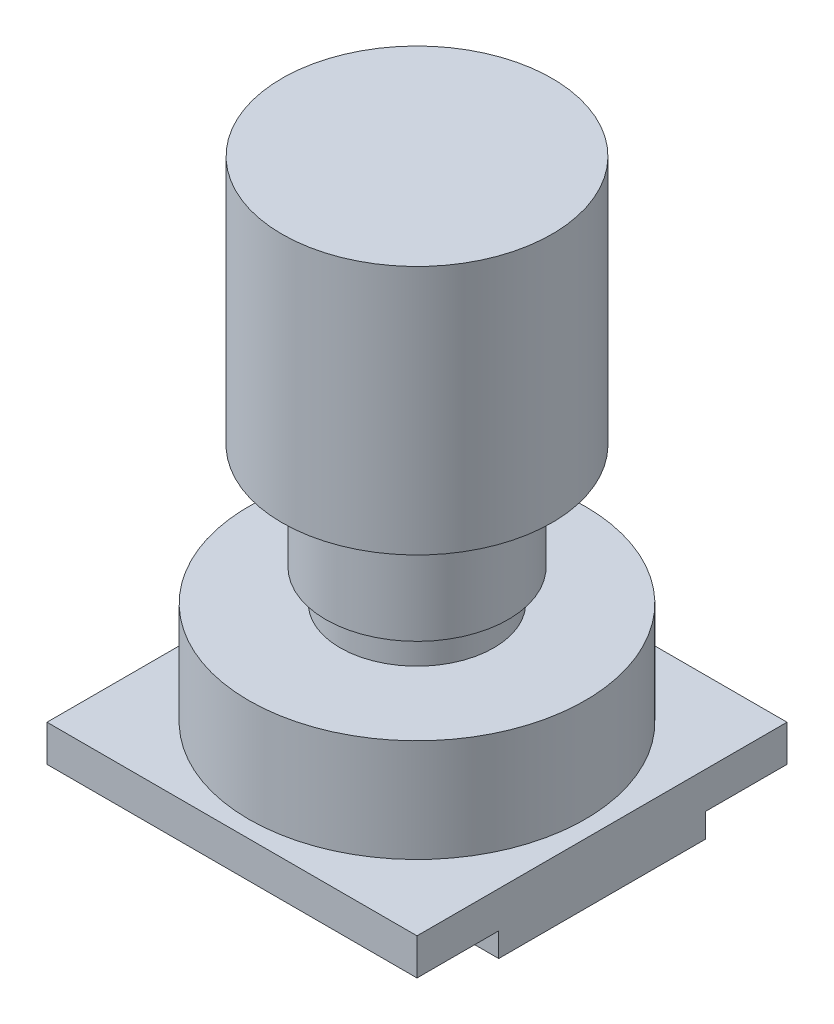
ISO-10303-21;
HEADER;
FILE_DESCRIPTION(('STEP AP214'),'2;1');
FILE_NAME('part.step','',(''),(''),'','','');
FILE_SCHEMA(('AUTOMOTIVE_DESIGN { 1 0 10303 214 1 1 1 1 }'));
ENDSEC;
DATA;
#1=APPLICATION_CONTEXT('core data for automotive mechanical design processes');
#2=APPLICATION_PROTOCOL_DEFINITION('international standard','automotive_design',2000,#1);
#3=PRODUCT_CONTEXT('',#1,'mechanical');
#4=PRODUCT('Part','Part','',(#3));
#5=PRODUCT_RELATED_PRODUCT_CATEGORY('part','',(#4));
#6=PRODUCT_DEFINITION_FORMATION('','',#4);
#7=PRODUCT_DEFINITION_CONTEXT('part definition',#1,'design');
#8=PRODUCT_DEFINITION('design','',#6,#7);
#9=PRODUCT_DEFINITION_SHAPE('','',#8);
#10=(LENGTH_UNIT() NAMED_UNIT(*) SI_UNIT(.MILLI.,.METRE.));
#11=(NAMED_UNIT(*) PLANE_ANGLE_UNIT() SI_UNIT($,.RADIAN.));
#12=(NAMED_UNIT(*) SI_UNIT($,.STERADIAN.) SOLID_ANGLE_UNIT());
#13=UNCERTAINTY_MEASURE_WITH_UNIT(LENGTH_MEASURE(1.E-05),#10,'distance_accuracy_value','');
#14=(GEOMETRIC_REPRESENTATION_CONTEXT(3) GLOBAL_UNCERTAINTY_ASSIGNED_CONTEXT((#13)) GLOBAL_UNIT_ASSIGNED_CONTEXT((#10,
#11,#12)) REPRESENTATION_CONTEXT('',''));
#15=CARTESIAN_POINT('',(0.,0.,0.));
#16=DIRECTION('',(0.,0.,1.));
#17=DIRECTION('',(1.,0.,0.));
#18=AXIS2_PLACEMENT_3D('',#15,#16,#17);
#19=CARTESIAN_POINT('',(19.25,3.8,19.25));
#20=DIRECTION('',(-1.,0.,0.));
#21=DIRECTION('',(0.,0.,1.));
#22=AXIS2_PLACEMENT_3D('',#19,#20,#21);
#23=PLANE('',#22);
#24=DIRECTION('',(0.,0.,-1.));
#25=VECTOR('',#24,1.);
#26=CARTESIAN_POINT('',(19.25,0.,19.25));
#27=LINE('',#26,#25);
#28=CARTESIAN_POINT('',(19.25,0.,19.25));
#29=VERTEX_POINT('',#28);
#30=CARTESIAN_POINT('',(19.25,0.,10.75));
#31=VERTEX_POINT('',#30);
#32=EDGE_CURVE('E136',#29,#31,#27,.T.);
#33=ORIENTED_EDGE('',*,*,#32,.T.);
#34=DIRECTION('',(0.,1.,0.));
#35=VECTOR('',#34,1.);
#36=CARTESIAN_POINT('',(19.25,-2.5,10.75));
#37=LINE('',#36,#35);
#38=CARTESIAN_POINT('',(19.25,-2.5,10.75));
#39=VERTEX_POINT('',#38);
#40=EDGE_CURVE('E115',#39,#31,#37,.T.);
#41=ORIENTED_EDGE('',*,*,#40,.F.);
#42=DIRECTION('',(0.,0.,1.));
#43=VECTOR('',#42,1.);
#44=CARTESIAN_POINT('',(19.25,-2.5,-10.75));
#45=LINE('',#44,#43);
#46=CARTESIAN_POINT('',(19.25,-2.5,-10.75));
#47=VERTEX_POINT('',#46);
#48=EDGE_CURVE('E122',#47,#39,#45,.T.);
#49=ORIENTED_EDGE('',*,*,#48,.F.);
#50=DIRECTION('',(0.,1.,0.));
#51=VECTOR('',#50,1.);
#52=CARTESIAN_POINT('',(19.25,-2.5,-10.75));
#53=LINE('',#52,#51);
#54=CARTESIAN_POINT('',(19.25,0.,-10.75));
#55=VERTEX_POINT('',#54);
#56=EDGE_CURVE('E214',#47,#55,#53,.T.);
#57=ORIENTED_EDGE('',*,*,#56,.T.);
#58=CARTESIAN_POINT('',(19.25,0.,-19.25));
#59=VERTEX_POINT('',#58);
#60=EDGE_CURVE('E67',#55,#59,#27,.T.);
#61=ORIENTED_EDGE('',*,*,#60,.T.);
#62=DIRECTION('',(0.,-1.,0.));
#63=VECTOR('',#62,1.);
#64=CARTESIAN_POINT('',(19.25,3.8,-19.25));
#65=LINE('',#64,#63);
#66=CARTESIAN_POINT('',(19.25,3.8,-19.25));
#67=VERTEX_POINT('',#66);
#68=EDGE_CURVE('E48',#67,#59,#65,.T.);
#69=ORIENTED_EDGE('',*,*,#68,.F.);
#70=DIRECTION('',(0.,0.,-1.));
#71=VECTOR('',#70,1.);
#72=CARTESIAN_POINT('',(19.25,3.8,19.25));
#73=LINE('',#72,#71);
#74=CARTESIAN_POINT('',(19.25,3.8,19.25));
#75=VERTEX_POINT('',#74);
#76=EDGE_CURVE('E171',#75,#67,#73,.T.);
#77=ORIENTED_EDGE('',*,*,#76,.F.);
#78=DIRECTION('',(0.,-1.,0.));
#79=VECTOR('',#78,1.);
#80=CARTESIAN_POINT('',(19.25,3.8,19.25));
#81=LINE('',#80,#79);
#82=EDGE_CURVE('E185',#75,#29,#81,.T.);
#83=ORIENTED_EDGE('',*,*,#82,.T.);
#84=EDGE_LOOP('',(#33,#41,#49,#57,#61,#69,#77,#83));
#85=FACE_BOUND('',#84,.T.);
#86=ADVANCED_FACE('F45',(#85),#23,.F.);
#87=CARTESIAN_POINT('',(-19.25,3.8,-19.25));
#88=DIRECTION('',(0.,0.,1.));
#89=DIRECTION('',(1.,0.,0.));
#90=AXIS2_PLACEMENT_3D('',#87,#88,#89);
#91=PLANE('',#90);
#92=DIRECTION('',(-1.,0.,0.));
#93=VECTOR('',#92,1.);
#94=CARTESIAN_POINT('',(-19.25,0.,-19.25));
#95=LINE('',#94,#93);
#96=CARTESIAN_POINT('',(-19.25,0.,-19.25));
#97=VERTEX_POINT('',#96);
#98=EDGE_CURVE('E188',#59,#97,#95,.T.);
#99=ORIENTED_EDGE('',*,*,#98,.T.);
#100=DIRECTION('',(0.,-1.,0.));
#101=VECTOR('',#100,1.);
#102=CARTESIAN_POINT('',(-19.25,3.8,-19.25));
#103=LINE('',#102,#101);
#104=CARTESIAN_POINT('',(-19.25,3.8,-19.25));
#105=VERTEX_POINT('',#104);
#106=EDGE_CURVE('E201',#105,#97,#103,.T.);
#107=ORIENTED_EDGE('',*,*,#106,.F.);
#108=DIRECTION('',(-1.,0.,0.));
#109=VECTOR('',#108,1.);
#110=CARTESIAN_POINT('',(-19.25,3.8,-19.25));
#111=LINE('',#110,#109);
#112=EDGE_CURVE('E175',#67,#105,#111,.T.);
#113=ORIENTED_EDGE('',*,*,#112,.F.);
#114=ORIENTED_EDGE('',*,*,#68,.T.);
#115=EDGE_LOOP('',(#99,#107,#113,#114));
#116=FACE_BOUND('',#115,.T.);
#117=ADVANCED_FACE('F212',(#116),#91,.F.);
#118=CARTESIAN_POINT('',(-19.25,3.8,19.25));
#119=DIRECTION('',(1.,0.,0.));
#120=DIRECTION('',(0.,0.,-1.));
#121=AXIS2_PLACEMENT_3D('',#118,#119,#120);
#122=PLANE('',#121);
#123=DIRECTION('',(0.,0.,1.));
#124=VECTOR('',#123,1.);
#125=CARTESIAN_POINT('',(-19.25,0.,19.25));
#126=LINE('',#125,#124);
#127=CARTESIAN_POINT('',(-19.25,0.,19.25));
#128=VERTEX_POINT('',#127);
#129=EDGE_CURVE('E191',#97,#128,#126,.T.);
#130=ORIENTED_EDGE('',*,*,#129,.T.);
#131=DIRECTION('',(0.,-1.,0.));
#132=VECTOR('',#131,1.);
#133=CARTESIAN_POINT('',(-19.25,3.8,19.25));
#134=LINE('',#133,#132);
#135=CARTESIAN_POINT('',(-19.25,3.8,19.25));
#136=VERTEX_POINT('',#135);
#137=EDGE_CURVE('E198',#136,#128,#134,.T.);
#138=ORIENTED_EDGE('',*,*,#137,.F.);
#139=DIRECTION('',(0.,0.,1.));
#140=VECTOR('',#139,1.);
#141=CARTESIAN_POINT('',(-19.25,3.8,19.25));
#142=LINE('',#141,#140);
#143=EDGE_CURVE('E179',#105,#136,#142,.T.);
#144=ORIENTED_EDGE('',*,*,#143,.F.);
#145=ORIENTED_EDGE('',*,*,#106,.T.);
#146=EDGE_LOOP('',(#130,#138,#144,#145));
#147=FACE_BOUND('',#146,.T.);
#148=ADVANCED_FACE('F219',(#147),#122,.F.);
#149=CARTESIAN_POINT('',(-19.25,3.8,19.25));
#150=DIRECTION('',(0.,0.,-1.));
#151=DIRECTION('',(-1.,0.,0.));
#152=AXIS2_PLACEMENT_3D('',#149,#150,#151);
#153=PLANE('',#152);
#154=DIRECTION('',(1.,0.,0.));
#155=VECTOR('',#154,1.);
#156=CARTESIAN_POINT('',(-19.25,0.,19.25));
#157=LINE('',#156,#155);
#158=EDGE_CURVE('E176',#128,#29,#157,.T.);
#159=ORIENTED_EDGE('',*,*,#158,.T.);
#160=ORIENTED_EDGE('',*,*,#82,.F.);
#161=DIRECTION('',(1.,0.,0.));
#162=VECTOR('',#161,1.);
#163=CARTESIAN_POINT('',(-19.25,3.8,19.25));
#164=LINE('',#163,#162);
#165=EDGE_CURVE('E182',#136,#75,#164,.T.);
#166=ORIENTED_EDGE('',*,*,#165,.F.);
#167=ORIENTED_EDGE('',*,*,#137,.T.);
#168=EDGE_LOOP('',(#159,#160,#166,#167));
#169=FACE_BOUND('',#168,.T.);
#170=ADVANCED_FACE('F222',(#169),#153,.F.);
#171=CARTESIAN_POINT('',(0.,3.8,0.));
#172=DIRECTION('',(0.,-1.,0.));
#173=DIRECTION('',(0.,0.,-1.));
#174=AXIS2_PLACEMENT_3D('',#171,#172,#173);
#175=PLANE('',#174);
#176=CARTESIAN_POINT('',(0.,3.8,0.));
#177=DIRECTION('',(0.,1.,0.));
#178=DIRECTION('',(0.,0.,1.));
#179=AXIS2_PLACEMENT_3D('',#176,#177,#178);
#180=CIRCLE('',#179,17.5);
#181=CARTESIAN_POINT('',(0.,3.8,17.5));
#182=VERTEX_POINT('',#181);
#183=EDGE_CURVE('E54',#182,#182,#180,.T.);
#184=ORIENTED_EDGE('',*,*,#183,.F.);
#185=EDGE_LOOP('',(#184));
#186=FACE_BOUND('',#185,.T.);
#187=ORIENTED_EDGE('',*,*,#76,.T.);
#188=ORIENTED_EDGE('',*,*,#112,.T.);
#189=ORIENTED_EDGE('',*,*,#143,.T.);
#190=ORIENTED_EDGE('',*,*,#165,.T.);
#191=EDGE_LOOP('',(#187,#188,#189,#190));
#192=FACE_BOUND('',#191,.T.);
#193=ADVANCED_FACE('F225',(#186,#192),#175,.F.);
#194=CARTESIAN_POINT('',(0.,0.,0.));
#195=DIRECTION('',(0.,-1.,0.));
#196=DIRECTION('',(0.,0.,-1.));
#197=AXIS2_PLACEMENT_3D('',#194,#195,#196);
#198=PLANE('',#197);
#199=DIRECTION('',(1.,0.,0.));
#200=VECTOR('',#199,1.);
#201=CARTESIAN_POINT('',(19.25,0.,-10.75));
#202=LINE('',#201,#200);
#203=CARTESIAN_POINT('',(13.25,0.,-10.75));
#204=VERTEX_POINT('',#203);
#205=EDGE_CURVE('E62',#204,#55,#202,.T.);
#206=ORIENTED_EDGE('',*,*,#205,.F.);
#207=DIRECTION('',(0.,0.,-1.));
#208=VECTOR('',#207,1.);
#209=CARTESIAN_POINT('',(13.25,0.,-10.75));
#210=LINE('',#209,#208);
#211=CARTESIAN_POINT('',(13.25,0.,10.75));
#212=VERTEX_POINT('',#211);
#213=EDGE_CURVE('E390',#212,#204,#210,.T.);
#214=ORIENTED_EDGE('',*,*,#213,.F.);
#215=DIRECTION('',(-1.,0.,0.));
#216=VECTOR('',#215,1.);
#217=CARTESIAN_POINT('',(19.25,0.,10.75));
#218=LINE('',#217,#216);
#219=EDGE_CURVE('E393',#31,#212,#218,.T.);
#220=ORIENTED_EDGE('',*,*,#219,.F.);
#221=ORIENTED_EDGE('',*,*,#32,.F.);
#222=ORIENTED_EDGE('',*,*,#158,.F.);
#223=ORIENTED_EDGE('',*,*,#129,.F.);
#224=ORIENTED_EDGE('',*,*,#98,.F.);
#225=ORIENTED_EDGE('',*,*,#60,.F.);
#226=EDGE_LOOP('',(#206,#214,#220,#221,#222,#223,#224,#225));
#227=FACE_BOUND('',#226,.T.);
#228=ADVANCED_FACE('F216',(#227),#198,.T.);
#229=CARTESIAN_POINT('',(0.,14.5,0.));
#230=DIRECTION('',(0.,-1.,0.));
#231=DIRECTION('',(0.,0.,-1.));
#232=AXIS2_PLACEMENT_3D('',#229,#230,#231);
#233=CYLINDRICAL_SURFACE('',#232,17.5);
#234=CARTESIAN_POINT('',(0.,14.5,0.));
#235=DIRECTION('',(0.,1.,0.));
#236=DIRECTION('',(0.,0.,1.));
#237=AXIS2_PLACEMENT_3D('',#234,#235,#236);
#238=CIRCLE('',#237,17.5);
#239=CARTESIAN_POINT('',(0.,14.5,17.5));
#240=VERTEX_POINT('',#239);
#241=EDGE_CURVE('E163',#240,#240,#238,.T.);
#242=ORIENTED_EDGE('',*,*,#241,.F.);
#243=EDGE_LOOP('',(#242));
#244=FACE_BOUND('',#243,.T.);
#245=ORIENTED_EDGE('',*,*,#183,.T.);
#246=EDGE_LOOP('',(#245));
#247=FACE_BOUND('',#246,.T.);
#248=ADVANCED_FACE('F234',(#244,#247),#233,.T.);
#249=CARTESIAN_POINT('',(0.,14.5,0.));
#250=DIRECTION('',(0.,1.,0.));
#251=DIRECTION('',(0.,0.,1.));
#252=AXIS2_PLACEMENT_3D('',#249,#250,#251);
#253=PLANE('',#252);
#254=CARTESIAN_POINT('',(0.,14.5,0.));
#255=DIRECTION('',(0.,1.,0.));
#256=DIRECTION('',(0.,0.,1.));
#257=AXIS2_PLACEMENT_3D('',#254,#255,#256);
#258=CIRCLE('',#257,8.);
#259=CARTESIAN_POINT('',(0.,14.5,8.));
#260=VERTEX_POINT('',#259);
#261=EDGE_CURVE('E11',#260,#260,#258,.T.);
#262=ORIENTED_EDGE('',*,*,#261,.F.);
#263=EDGE_LOOP('',(#262));
#264=FACE_BOUND('',#263,.T.);
#265=ORIENTED_EDGE('',*,*,#241,.T.);
#266=EDGE_LOOP('',(#265));
#267=FACE_BOUND('',#266,.T.);
#268=ADVANCED_FACE('F275',(#264,#267),#253,.T.);
#269=CARTESIAN_POINT('',(0.,17.8,0.));
#270=DIRECTION('',(0.,-1.,0.));
#271=DIRECTION('',(0.,0.,-1.));
#272=AXIS2_PLACEMENT_3D('',#269,#270,#271);
#273=CYLINDRICAL_SURFACE('',#272,8.);
#274=CARTESIAN_POINT('',(0.,17.8,0.));
#275=DIRECTION('',(0.,1.,0.));
#276=DIRECTION('',(0.,0.,1.));
#277=AXIS2_PLACEMENT_3D('',#274,#275,#276);
#278=CIRCLE('',#277,8.);
#279=CARTESIAN_POINT('',(0.,17.8,8.));
#280=VERTEX_POINT('',#279);
#281=EDGE_CURVE('E157',#280,#280,#278,.T.);
#282=ORIENTED_EDGE('',*,*,#281,.F.);
#283=EDGE_LOOP('',(#282));
#284=FACE_BOUND('',#283,.T.);
#285=ORIENTED_EDGE('',*,*,#261,.T.);
#286=EDGE_LOOP('',(#285));
#287=FACE_BOUND('',#286,.T.);
#288=ADVANCED_FACE('F284',(#284,#287),#273,.T.);
#289=CARTESIAN_POINT('',(0.,28.8,0.));
#290=DIRECTION('',(0.,-1.,0.));
#291=DIRECTION('',(0.,0.,-1.));
#292=AXIS2_PLACEMENT_3D('',#289,#290,#291);
#293=CYLINDRICAL_SURFACE('',#292,9.5);
#294=CARTESIAN_POINT('',(0.,28.8,0.));
#295=DIRECTION('',(0.,1.,0.));
#296=DIRECTION('',(0.,0.,1.));
#297=AXIS2_PLACEMENT_3D('',#294,#295,#296);
#298=CIRCLE('',#297,9.5);
#299=CARTESIAN_POINT('',(0.,28.8,9.5));
#300=VERTEX_POINT('',#299);
#301=EDGE_CURVE('E153',#300,#300,#298,.T.);
#302=ORIENTED_EDGE('',*,*,#301,.F.);
#303=EDGE_LOOP('',(#302));
#304=FACE_BOUND('',#303,.T.);
#305=CARTESIAN_POINT('',(0.,17.8,0.));
#306=DIRECTION('',(0.,1.,0.));
#307=DIRECTION('',(0.,0.,1.));
#308=AXIS2_PLACEMENT_3D('',#305,#306,#307);
#309=CIRCLE('',#308,9.5);
#310=CARTESIAN_POINT('',(0.,17.8,9.5));
#311=VERTEX_POINT('',#310);
#312=EDGE_CURVE('E151',#311,#311,#309,.T.);
#313=ORIENTED_EDGE('',*,*,#312,.T.);
#314=EDGE_LOOP('',(#313));
#315=FACE_BOUND('',#314,.T.);
#316=ADVANCED_FACE('F294',(#304,#315),#293,.T.);
#317=CARTESIAN_POINT('',(0.,17.8,0.));
#318=DIRECTION('',(0.,1.,0.));
#319=DIRECTION('',(0.,0.,1.));
#320=AXIS2_PLACEMENT_3D('',#317,#318,#319);
#321=PLANE('',#320);
#322=ORIENTED_EDGE('',*,*,#281,.T.);
#323=EDGE_LOOP('',(#322));
#324=FACE_BOUND('',#323,.T.);
#325=ORIENTED_EDGE('',*,*,#312,.F.);
#326=EDGE_LOOP('',(#325));
#327=FACE_BOUND('',#326,.T.);
#328=ADVANCED_FACE('F304',(#324,#327),#321,.F.);
#329=CARTESIAN_POINT('',(0.,54.8,0.));
#330=DIRECTION('',(0.,-1.,0.));
#331=DIRECTION('',(0.,0.,-1.));
#332=AXIS2_PLACEMENT_3D('',#329,#330,#331);
#333=CYLINDRICAL_SURFACE('',#332,14.05);
#334=CARTESIAN_POINT('',(0.,54.8,0.));
#335=DIRECTION('',(0.,1.,0.));
#336=DIRECTION('',(0.,0.,1.));
#337=AXIS2_PLACEMENT_3D('',#334,#335,#336);
#338=CIRCLE('',#337,14.05);
#339=CARTESIAN_POINT('',(0.,54.8,14.05));
#340=VERTEX_POINT('',#339);
#341=EDGE_CURVE('E143',#340,#340,#338,.T.);
#342=ORIENTED_EDGE('',*,*,#341,.F.);
#343=EDGE_LOOP('',(#342));
#344=FACE_BOUND('',#343,.T.);
#345=CARTESIAN_POINT('',(0.,28.8,0.));
#346=DIRECTION('',(0.,1.,0.));
#347=DIRECTION('',(0.,0.,1.));
#348=AXIS2_PLACEMENT_3D('',#345,#346,#347);
#349=CIRCLE('',#348,14.05);
#350=CARTESIAN_POINT('',(0.,28.8,14.05));
#351=VERTEX_POINT('',#350);
#352=EDGE_CURVE('E138',#351,#351,#349,.T.);
#353=ORIENTED_EDGE('',*,*,#352,.T.);
#354=EDGE_LOOP('',(#353));
#355=FACE_BOUND('',#354,.T.);
#356=ADVANCED_FACE('F314',(#344,#355),#333,.T.);
#357=CARTESIAN_POINT('',(0.,54.8,0.));
#358=DIRECTION('',(0.,1.,0.));
#359=DIRECTION('',(0.,0.,1.));
#360=AXIS2_PLACEMENT_3D('',#357,#358,#359);
#361=PLANE('',#360);
#362=ORIENTED_EDGE('',*,*,#341,.T.);
#363=EDGE_LOOP('',(#362));
#364=FACE_BOUND('',#363,.T.);
#365=ADVANCED_FACE('F324',(#364),#361,.T.);
#366=CARTESIAN_POINT('',(0.,28.8,0.));
#367=DIRECTION('',(0.,1.,0.));
#368=DIRECTION('',(0.,0.,1.));
#369=AXIS2_PLACEMENT_3D('',#366,#367,#368);
#370=PLANE('',#369);
#371=ORIENTED_EDGE('',*,*,#301,.T.);
#372=EDGE_LOOP('',(#371));
#373=FACE_BOUND('',#372,.T.);
#374=ORIENTED_EDGE('',*,*,#352,.F.);
#375=EDGE_LOOP('',(#374));
#376=FACE_BOUND('',#375,.T.);
#377=ADVANCED_FACE('F334',(#373,#376),#370,.F.);
#378=CARTESIAN_POINT('',(19.25,-2.5,10.75));
#379=DIRECTION('',(0.,0.,-1.));
#380=DIRECTION('',(-1.,0.,0.));
#381=AXIS2_PLACEMENT_3D('',#378,#379,#380);
#382=PLANE('',#381);
#383=ORIENTED_EDGE('',*,*,#219,.T.);
#384=DIRECTION('',(0.,1.,0.));
#385=VECTOR('',#384,1.);
#386=CARTESIAN_POINT('',(13.25,-2.5,10.75));
#387=LINE('',#386,#385);
#388=CARTESIAN_POINT('',(13.25,-2.5,10.75));
#389=VERTEX_POINT('',#388);
#390=EDGE_CURVE('E117',#389,#212,#387,.T.);
#391=ORIENTED_EDGE('',*,*,#390,.F.);
#392=DIRECTION('',(-1.,0.,0.));
#393=VECTOR('',#392,1.);
#394=CARTESIAN_POINT('',(19.25,-2.5,10.75));
#395=LINE('',#394,#393);
#396=EDGE_CURVE('E110',#39,#389,#395,.T.);
#397=ORIENTED_EDGE('',*,*,#396,.F.);
#398=ORIENTED_EDGE('',*,*,#40,.T.);
#399=EDGE_LOOP('',(#383,#391,#397,#398));
#400=FACE_BOUND('',#399,.T.);
#401=ADVANCED_FACE('F113',(#400),#382,.F.);
#402=CARTESIAN_POINT('',(13.25,-2.5,-10.75));
#403=DIRECTION('',(1.,0.,0.));
#404=DIRECTION('',(0.,0.,-1.));
#405=AXIS2_PLACEMENT_3D('',#402,#403,#404);
#406=PLANE('',#405);
#407=ORIENTED_EDGE('',*,*,#213,.T.);
#408=DIRECTION('',(0.,1.,0.));
#409=VECTOR('',#408,1.);
#410=CARTESIAN_POINT('',(13.25,-2.5,-10.75));
#411=LINE('',#410,#409);
#412=CARTESIAN_POINT('',(13.25,-2.5,-10.75));
#413=VERTEX_POINT('',#412);
#414=EDGE_CURVE('E145',#413,#204,#411,.T.);
#415=ORIENTED_EDGE('',*,*,#414,.F.);
#416=DIRECTION('',(0.,0.,-1.));
#417=VECTOR('',#416,1.);
#418=CARTESIAN_POINT('',(13.25,-2.5,-10.75));
#419=LINE('',#418,#417);
#420=EDGE_CURVE('E121',#389,#413,#419,.T.);
#421=ORIENTED_EDGE('',*,*,#420,.F.);
#422=ORIENTED_EDGE('',*,*,#390,.T.);
#423=EDGE_LOOP('',(#407,#415,#421,#422));
#424=FACE_BOUND('',#423,.T.);
#425=ADVANCED_FACE('F357',(#424),#406,.F.);
#426=CARTESIAN_POINT('',(19.25,-2.5,-10.75));
#427=DIRECTION('',(0.,0.,1.));
#428=DIRECTION('',(1.,0.,0.));
#429=AXIS2_PLACEMENT_3D('',#426,#427,#428);
#430=PLANE('',#429);
#431=ORIENTED_EDGE('',*,*,#205,.T.);
#432=ORIENTED_EDGE('',*,*,#56,.F.);
#433=DIRECTION('',(1.,0.,0.));
#434=VECTOR('',#433,1.);
#435=CARTESIAN_POINT('',(19.25,-2.5,-10.75));
#436=LINE('',#435,#434);
#437=EDGE_CURVE('E127',#413,#47,#436,.T.);
#438=ORIENTED_EDGE('',*,*,#437,.F.);
#439=ORIENTED_EDGE('',*,*,#414,.T.);
#440=EDGE_LOOP('',(#431,#432,#438,#439));
#441=FACE_BOUND('',#440,.T.);
#442=ADVANCED_FACE('F366',(#441),#430,.F.);
#443=CARTESIAN_POINT('',(0.,-2.5,0.));
#444=DIRECTION('',(0.,-1.,0.));
#445=DIRECTION('',(0.,0.,-1.));
#446=AXIS2_PLACEMENT_3D('',#443,#444,#445);
#447=PLANE('',#446);
#448=ORIENTED_EDGE('',*,*,#48,.T.);
#449=ORIENTED_EDGE('',*,*,#396,.T.);
#450=ORIENTED_EDGE('',*,*,#420,.T.);
#451=ORIENTED_EDGE('',*,*,#437,.T.);
#452=EDGE_LOOP('',(#448,#449,#450,#451));
#453=FACE_BOUND('',#452,.T.);
#454=ADVANCED_FACE('F125',(#453),#447,.T.);
#455=CLOSED_SHELL('',(#86,#117,#148,#170,#193,#228,#248,#268,#288,#316,#328,#356,#365,#377,#401,
#425,#442,#454));
#456=MANIFOLD_SOLID_BREP('B2',#455);
#457=ADVANCED_BREP_SHAPE_REPRESENTATION('',(#18,#456),#14);
#458=SHAPE_DEFINITION_REPRESENTATION(#9,#457);
ENDSEC;
END-ISO-10303-21;
